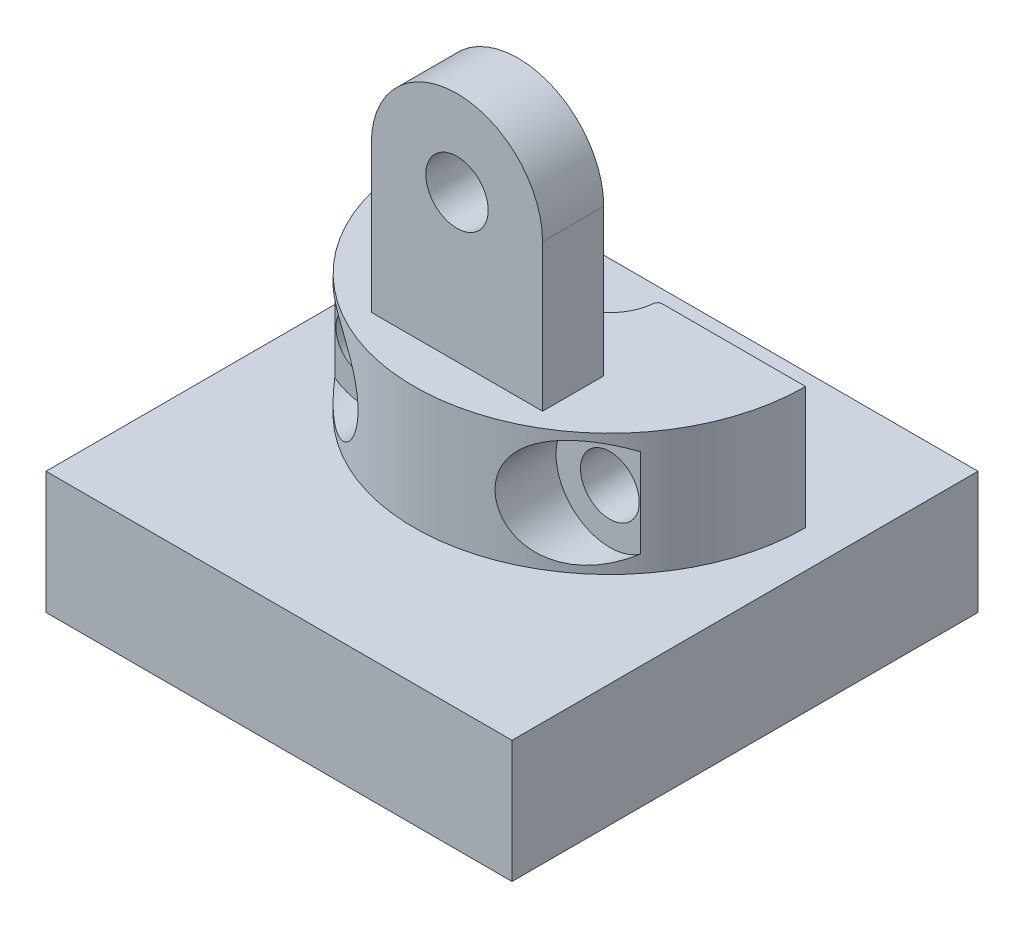
ISO-10303-21;
HEADER;
FILE_DESCRIPTION(('STEP AP214'),'2;1');
FILE_NAME('part.step','',(''),(''),'','','');
FILE_SCHEMA(('AUTOMOTIVE_DESIGN { 1 0 10303 214 1 1 1 1 }'));
ENDSEC;
DATA;
#1=APPLICATION_CONTEXT('core data for automotive mechanical design processes');
#2=APPLICATION_PROTOCOL_DEFINITION('international standard','automotive_design',2000,#1);
#3=PRODUCT_CONTEXT('',#1,'mechanical');
#4=PRODUCT('Part','Part','',(#3));
#5=PRODUCT_RELATED_PRODUCT_CATEGORY('part','',(#4));
#6=PRODUCT_DEFINITION_FORMATION('','',#4);
#7=PRODUCT_DEFINITION_CONTEXT('part definition',#1,'design');
#8=PRODUCT_DEFINITION('design','',#6,#7);
#9=PRODUCT_DEFINITION_SHAPE('','',#8);
#10=(LENGTH_UNIT() NAMED_UNIT(*) SI_UNIT(.MILLI.,.METRE.));
#11=(NAMED_UNIT(*) PLANE_ANGLE_UNIT() SI_UNIT($,.RADIAN.));
#12=(NAMED_UNIT(*) SI_UNIT($,.STERADIAN.) SOLID_ANGLE_UNIT());
#13=UNCERTAINTY_MEASURE_WITH_UNIT(LENGTH_MEASURE(1.E-05),#10,'distance_accuracy_value','');
#14=(GEOMETRIC_REPRESENTATION_CONTEXT(3) GLOBAL_UNCERTAINTY_ASSIGNED_CONTEXT((#13)) GLOBAL_UNIT_ASSIGNED_CONTEXT((#10,
#11,#12)) REPRESENTATION_CONTEXT('',''));
#15=CARTESIAN_POINT('',(0.,0.,0.));
#16=DIRECTION('',(0.,0.,1.));
#17=DIRECTION('',(1.,0.,0.));
#18=AXIS2_PLACEMENT_3D('',#15,#16,#17);
#19=CARTESIAN_POINT('',(3.5,12.,6.25));
#20=DIRECTION('',(0.,0.,1.));
#21=DIRECTION('',(1.,0.,0.));
#22=AXIS2_PLACEMENT_3D('',#19,#20,#21);
#23=PLANE('',#22);
#24=CARTESIAN_POINT('',(0.,8.5,6.25));
#25=DIRECTION('',(0.,0.,1.));
#26=DIRECTION('',(1.,0.,0.));
#27=AXIS2_PLACEMENT_3D('',#24,#25,#26);
#28=CIRCLE('',#27,1.275);
#29=CARTESIAN_POINT('',(1.275,8.5,6.25));
#30=VERTEX_POINT('',#29);
#31=EDGE_CURVE('E199',#30,#30,#28,.T.);
#32=ORIENTED_EDGE('',*,*,#31,.F.);
#33=EDGE_LOOP('',(#32));
#34=FACE_BOUND('',#33,.T.);
#35=DIRECTION('',(0.,-1.,0.));
#36=VECTOR('',#35,1.);
#37=CARTESIAN_POINT('',(3.5,12.,6.25));
#38=LINE('',#37,#36);
#39=CARTESIAN_POINT('',(3.5,8.5,6.25));
#40=VERTEX_POINT('',#39);
#41=CARTESIAN_POINT('',(3.5,2.5,6.25));
#42=VERTEX_POINT('',#41);
#43=EDGE_CURVE('E244',#40,#42,#38,.T.);
#44=ORIENTED_EDGE('',*,*,#43,.F.);
#45=CARTESIAN_POINT('',(0.,8.5,6.25));
#46=DIRECTION('',(0.,0.,1.));
#47=DIRECTION('',(1.,0.,0.));
#48=AXIS2_PLACEMENT_3D('',#45,#46,#47);
#49=CIRCLE('',#48,3.5);
#50=CARTESIAN_POINT('',(-3.5,8.5,6.25));
#51=VERTEX_POINT('',#50);
#52=EDGE_CURVE('E210',#40,#51,#49,.T.);
#53=ORIENTED_EDGE('',*,*,#52,.T.);
#54=DIRECTION('',(0.,-1.,0.));
#55=VECTOR('',#54,1.);
#56=CARTESIAN_POINT('',(-3.5,12.,6.25));
#57=LINE('',#56,#55);
#58=CARTESIAN_POINT('',(-3.5,2.5,6.25));
#59=VERTEX_POINT('',#58);
#60=EDGE_CURVE('E254',#51,#59,#57,.T.);
#61=ORIENTED_EDGE('',*,*,#60,.T.);
#62=DIRECTION('',(-1.,0.,0.));
#63=VECTOR('',#62,1.);
#64=CARTESIAN_POINT('',(3.5,2.5,6.25));
#65=LINE('',#64,#63);
#66=EDGE_CURVE('E212',#42,#59,#65,.T.);
#67=ORIENTED_EDGE('',*,*,#66,.F.);
#68=EDGE_LOOP('',(#44,#53,#61,#67));
#69=FACE_BOUND('',#68,.T.);
#70=ADVANCED_FACE('F37',(#34,#69),#23,.T.);
#71=CARTESIAN_POINT('',(3.5,12.,6.25));
#72=DIRECTION('',(-1.,0.,0.));
#73=DIRECTION('',(0.,0.,1.));
#74=AXIS2_PLACEMENT_3D('',#71,#72,#73);
#75=PLANE('',#74);
#76=DIRECTION('',(0.,0.,-1.));
#77=VECTOR('',#76,1.);
#78=CARTESIAN_POINT('',(3.5,8.5,13.25));
#79=LINE('',#78,#77);
#80=CARTESIAN_POINT('',(3.5,8.5,3.75));
#81=VERTEX_POINT('',#80);
#82=EDGE_CURVE('E205',#40,#81,#79,.T.);
#83=ORIENTED_EDGE('',*,*,#82,.F.);
#84=ORIENTED_EDGE('',*,*,#43,.T.);
#85=DIRECTION('',(0.,0.,-1.));
#86=VECTOR('',#85,1.);
#87=CARTESIAN_POINT('',(3.5,2.5,6.25));
#88=LINE('',#87,#86);
#89=CARTESIAN_POINT('',(3.5,2.5,3.75));
#90=VERTEX_POINT('',#89);
#91=EDGE_CURVE('E257',#42,#90,#88,.T.);
#92=ORIENTED_EDGE('',*,*,#91,.T.);
#93=DIRECTION('',(0.,-1.,0.));
#94=VECTOR('',#93,1.);
#95=CARTESIAN_POINT('',(3.5,12.,3.75));
#96=LINE('',#95,#94);
#97=EDGE_CURVE('E259',#81,#90,#96,.T.);
#98=ORIENTED_EDGE('',*,*,#97,.F.);
#99=EDGE_LOOP('',(#83,#84,#92,#98));
#100=FACE_BOUND('',#99,.T.);
#101=ADVANCED_FACE('F282',(#100),#75,.F.);
#102=CARTESIAN_POINT('',(3.5,12.,3.75));
#103=DIRECTION('',(0.,0.,1.));
#104=DIRECTION('',(1.,0.,0.));
#105=AXIS2_PLACEMENT_3D('',#102,#103,#104);
#106=PLANE('',#105);
#107=CARTESIAN_POINT('',(0.,8.5,3.75));
#108=DIRECTION('',(0.,0.,-1.));
#109=DIRECTION('',(-1.,0.,0.));
#110=AXIS2_PLACEMENT_3D('',#107,#108,#109);
#111=CIRCLE('',#110,1.275);
#112=CARTESIAN_POINT('',(-1.275,8.5,3.75));
#113=VERTEX_POINT('',#112);
#114=EDGE_CURVE('E196',#113,#113,#111,.T.);
#115=ORIENTED_EDGE('',*,*,#114,.F.);
#116=EDGE_LOOP('',(#115));
#117=FACE_BOUND('',#116,.T.);
#118=CARTESIAN_POINT('',(0.,8.5,3.75));
#119=DIRECTION('',(0.,0.,-1.));
#120=DIRECTION('',(-1.,0.,0.));
#121=AXIS2_PLACEMENT_3D('',#118,#119,#120);
#122=CIRCLE('',#121,3.5);
#123=CARTESIAN_POINT('',(-3.5,8.5,3.75));
#124=VERTEX_POINT('',#123);
#125=EDGE_CURVE('E202',#124,#81,#122,.T.);
#126=ORIENTED_EDGE('',*,*,#125,.T.);
#127=ORIENTED_EDGE('',*,*,#97,.T.);
#128=DIRECTION('',(-1.,0.,0.));
#129=VECTOR('',#128,1.);
#130=CARTESIAN_POINT('',(3.5,2.5,3.75));
#131=LINE('',#130,#129);
#132=CARTESIAN_POINT('',(-3.5,2.5,3.75));
#133=VERTEX_POINT('',#132);
#134=EDGE_CURVE('E219',#90,#133,#131,.T.);
#135=ORIENTED_EDGE('',*,*,#134,.T.);
#136=DIRECTION('',(0.,-1.,0.));
#137=VECTOR('',#136,1.);
#138=CARTESIAN_POINT('',(-3.5,12.,3.75));
#139=LINE('',#138,#137);
#140=EDGE_CURVE('E256',#124,#133,#139,.T.);
#141=ORIENTED_EDGE('',*,*,#140,.F.);
#142=EDGE_LOOP('',(#126,#127,#135,#141));
#143=FACE_BOUND('',#142,.T.);
#144=ADVANCED_FACE('F269',(#117,#143),#106,.F.);
#145=CARTESIAN_POINT('',(0.,2.5,0.));
#146=DIRECTION('',(0.,-1.,0.));
#147=DIRECTION('',(0.,0.,-1.));
#148=AXIS2_PLACEMENT_3D('',#145,#146,#147);
#149=CYLINDRICAL_SURFACE('',#148,1.96);
#150=CARTESIAN_POINT('',(0.,-2.5,0.));
#151=DIRECTION('',(0.,-1.,0.));
#152=DIRECTION('',(0.,0.,-1.));
#153=AXIS2_PLACEMENT_3D('',#150,#151,#152);
#154=CIRCLE('',#153,1.96);
#155=CARTESIAN_POINT('',(1.95157999371773,-2.5,0.181481481481481));
#156=VERTEX_POINT('',#155);
#157=CARTESIAN_POINT('',(-1.95157999371773,-2.5,0.181481481481481));
#158=VERTEX_POINT('',#157);
#159=EDGE_CURVE('E240',#156,#158,#154,.T.);
#160=ORIENTED_EDGE('',*,*,#159,.T.);
#161=DIRECTION('',(0.,-1.,0.));
#162=VECTOR('',#161,1.);
#163=CARTESIAN_POINT('',(-1.95157999371773,2.5,0.181481481481481));
#164=LINE('',#163,#162);
#165=CARTESIAN_POINT('',(-1.95157999371773,2.5,0.181481481481481));
#166=VERTEX_POINT('',#165);
#167=EDGE_CURVE('E390',#158,#166,#164,.F.);
#168=ORIENTED_EDGE('',*,*,#167,.T.);
#169=CARTESIAN_POINT('',(0.,2.5,0.));
#170=DIRECTION('',(0.,-1.,0.));
#171=DIRECTION('',(0.,0.,-1.));
#172=AXIS2_PLACEMENT_3D('',#169,#170,#171);
#173=CIRCLE('',#172,1.96);
#174=CARTESIAN_POINT('',(1.95157999371773,2.5,0.181481481481481));
#175=VERTEX_POINT('',#174);
#176=EDGE_CURVE('E229',#175,#166,#173,.T.);
#177=ORIENTED_EDGE('',*,*,#176,.F.);
#178=DIRECTION('',(0.,-1.,0.));
#179=VECTOR('',#178,1.);
#180=CARTESIAN_POINT('',(1.95157999371773,2.5,0.181481481481481));
#181=LINE('',#180,#179);
#182=EDGE_CURVE('E404',#175,#156,#181,.T.);
#183=ORIENTED_EDGE('',*,*,#182,.T.);
#184=EDGE_LOOP('',(#160,#168,#177,#183));
#185=FACE_BOUND('',#184,.T.);
#186=ADVANCED_FACE('F364',(#185),#149,.F.);
#187=CARTESIAN_POINT('',(-1.96,2.5,0.));
#188=DIRECTION('',(0.,0.,1.));
#189=DIRECTION('',(1.,0.,0.));
#190=AXIS2_PLACEMENT_3D('',#187,#188,#189);
#191=PLANE('',#190);
#192=CARTESIAN_POINT('',(-5.,0.,0.));
#193=DIRECTION('',(0.,0.,1.));
#194=DIRECTION('',(1.,0.,0.));
#195=AXIS2_PLACEMENT_3D('',#192,#193,#194);
#196=CIRCLE('',#195,1.2);
#197=CARTESIAN_POINT('',(-3.8,0.,0.));
#198=VERTEX_POINT('',#197);
#199=EDGE_CURVE('E193',#198,#198,#196,.T.);
#200=ORIENTED_EDGE('',*,*,#199,.T.);
#201=EDGE_LOOP('',(#200));
#202=FACE_BOUND('',#201,.T.);
#203=DIRECTION('',(-1.,0.,0.));
#204=VECTOR('',#203,1.);
#205=CARTESIAN_POINT('',(-1.96,2.5,0.));
#206=LINE('',#205,#204);
#207=CARTESIAN_POINT('',(-2.15072080940321,2.5,0.));
#208=VERTEX_POINT('',#207);
#209=CARTESIAN_POINT('',(-8.,2.5,0.));
#210=VERTEX_POINT('',#209);
#211=EDGE_CURVE('E250',#208,#210,#206,.T.);
#212=ORIENTED_EDGE('',*,*,#211,.F.);
#213=DIRECTION('',(0.,-1.,0.));
#214=VECTOR('',#213,1.);
#215=CARTESIAN_POINT('',(-2.15072080940321,2.5,0.));
#216=LINE('',#215,#214);
#217=CARTESIAN_POINT('',(-2.15072080940321,-2.5,0.));
#218=VERTEX_POINT('',#217);
#219=EDGE_CURVE('E392',#208,#218,#216,.T.);
#220=ORIENTED_EDGE('',*,*,#219,.T.);
#221=DIRECTION('',(-1.,0.,0.));
#222=VECTOR('',#221,1.);
#223=CARTESIAN_POINT('',(-1.96,-2.5,0.));
#224=LINE('',#223,#222);
#225=CARTESIAN_POINT('',(-8.,-2.5,0.));
#226=VERTEX_POINT('',#225);
#227=EDGE_CURVE('E237',#218,#226,#224,.T.);
#228=ORIENTED_EDGE('',*,*,#227,.T.);
#229=DIRECTION('',(0.,-1.,0.));
#230=VECTOR('',#229,1.);
#231=CARTESIAN_POINT('',(-8.,2.5,0.));
#232=LINE('',#231,#230);
#233=EDGE_CURVE('E422',#210,#226,#232,.T.);
#234=ORIENTED_EDGE('',*,*,#233,.F.);
#235=EDGE_LOOP('',(#212,#220,#228,#234));
#236=FACE_BOUND('',#235,.T.);
#237=ADVANCED_FACE('F306',(#202,#236),#191,.F.);
#238=CARTESIAN_POINT('',(0.,2.5,0.));
#239=DIRECTION('',(0.,-1.,0.));
#240=DIRECTION('',(0.,0.,-1.));
#241=AXIS2_PLACEMENT_3D('',#238,#239,#240);
#242=CYLINDRICAL_SURFACE('',#241,8.);
#243=DIRECTION('',(0.,-1.,0.));
#244=VECTOR('',#243,1.);
#245=CARTESIAN_POINT('',(6.2449979983984,2.5,5.));
#246=LINE('',#245,#244);
#247=CARTESIAN_POINT('',(6.2449979983984,1.81383019711989,5.));
#248=VERTEX_POINT('',#247);
#249=CARTESIAN_POINT('',(6.2449979983984,-1.81383019711989,5.));
#250=VERTEX_POINT('',#249);
#251=EDGE_CURVE('E327',#248,#250,#246,.T.);
#252=ORIENTED_EDGE('',*,*,#251,.T.);
#253=CARTESIAN_POINT('',(6.2449979983984,-1.81383019711989,5.));
#254=CARTESIAN_POINT('',(6.17663860592241,-1.8607102834588,5.08540212173734));
#255=CARTESIAN_POINT('',(6.10549519642224,-1.90389776412766,5.17064944179791));
#256=CARTESIAN_POINT('',(5.95769073945838,-1.98239403807314,5.34027558496621));
#257=CARTESIAN_POINT('',(5.88101997446032,-2.01768848490826,5.42465256493792));
#258=CARTESIAN_POINT('',(5.72167796067273,-2.08003768105955,5.59248871845806));
#259=CARTESIAN_POINT('',(5.63895503716553,-2.10700782760362,5.67593066012418));
#260=CARTESIAN_POINT('',(5.46862895756308,-2.15130847146899,5.84021356424412));
#261=CARTESIAN_POINT('',(5.38102981779722,-2.16864677656134,5.92105658320298));
#262=CARTESIAN_POINT('',(5.16408914189433,-2.19761714024674,6.11235090478948));
#263=CARTESIAN_POINT('',(5.03251052155223,-2.20389550475201,6.22116736617875));
#264=CARTESIAN_POINT('',(4.76376961945145,-2.19138593064291,6.42924356138917));
#265=CARTESIAN_POINT('',(4.62663374461121,-2.17270552800541,6.52854233126517));
#266=CARTESIAN_POINT('',(4.38499438405445,-2.11498966742177,6.6923573050568));
#267=CARTESIAN_POINT('',(4.28075459328574,-2.08208552215906,6.75942394459143));
#268=CARTESIAN_POINT('',(4.07438089621389,-1.99889729341654,6.88578440694051));
#269=CARTESIAN_POINT('',(3.97224715500588,-1.94861185284847,6.94507762232662));
#270=CARTESIAN_POINT('',(3.77642686696404,-1.83180367159578,7.05342442007826));
#271=CARTESIAN_POINT('',(3.68258590544246,-1.76576119453198,7.10271317228207));
#272=CARTESIAN_POINT('',(3.50404841981326,-1.61728086688121,7.19247087999335));
#273=CARTESIAN_POINT('',(3.41935045109385,-1.53484561225418,7.23294122985889));
#274=CARTESIAN_POINT('',(3.26258125551041,-1.35486421807502,7.30500184587568));
#275=CARTESIAN_POINT('',(3.19054757401096,-1.25727470989678,7.33656586969469));
#276=CARTESIAN_POINT('',(3.06275519423315,-1.04972764254948,7.39083052225789));
#277=CARTESIAN_POINT('',(3.00699558129236,-0.939770778952615,7.41353164915367));
#278=CARTESIAN_POINT('',(2.91655056743105,-0.716296077405375,7.4495637705695));
#279=CARTESIAN_POINT('',(2.88099080849888,-0.603194713378326,7.46328823402145));
#280=CARTESIAN_POINT('',(2.8284674897464,-0.372126724375028,7.4833530594277));
#281=CARTESIAN_POINT('',(2.81150135884821,-0.254160774402274,7.48969444230248));
#282=CARTESIAN_POINT('',(2.79701611341606,-0.0194956684011316,7.49511559529466));
#283=CARTESIAN_POINT('',(2.79907712949005,0.0971742098036563,7.49435214375621));
#284=CARTESIAN_POINT('',(2.8215589099335,0.328468012502649,7.48591656357002));
#285=CARTESIAN_POINT('',(2.84197787893106,0.443092135949723,7.4782451105112));
#286=CARTESIAN_POINT('',(2.90028750712632,0.66672589423237,7.45582293202285));
#287=CARTESIAN_POINT('',(2.93812856387018,0.77575049837395,7.44109229995911));
#288=CARTESIAN_POINT('',(3.02977018092827,0.985544328622235,7.40424988459547));
#289=CARTESIAN_POINT('',(3.0835734163882,1.0863121673393,7.38213686398274));
#290=CARTESIAN_POINT('',(3.20559261947389,1.27794517322249,7.32998027725017));
#291=CARTESIAN_POINT('',(3.27395239109038,1.36869669634901,7.2998567764045));
#292=CARTESIAN_POINT('',(3.42192181315994,1.53694484268976,7.23166993986864));
#293=CARTESIAN_POINT('',(3.50152064511513,1.61445405595442,7.1936142229907));
#294=CARTESIAN_POINT('',(3.63101896966027,1.72322173103639,7.12869863861583));
#295=CARTESIAN_POINT('',(3.67810398493254,1.7595634833854,7.10454012091781));
#296=CARTESIAN_POINT('',(3.77420425269416,1.82781253333738,7.05395916171292));
#297=CARTESIAN_POINT('',(3.82321904621537,1.85972087727945,7.0275372567812));
#298=CARTESIAN_POINT('',(3.9897849303121,1.95906072319958,6.935367417718));
#299=CARTESIAN_POINT('',(4.11071543998058,2.0164422957166,6.86459051921834));
#300=CARTESIAN_POINT('',(4.35490644458693,2.10735258482268,6.71234752122969));
#301=CARTESIAN_POINT('',(4.47817186543769,2.14082330276661,6.63085599466348));
#302=CARTESIAN_POINT('',(4.72136790181883,2.18575324923757,6.45992204116997));
#303=CARTESIAN_POINT('',(4.84131847825671,2.1974065771265,6.37055720476197));
#304=CARTESIAN_POINT('',(5.07629158578847,2.20182198732416,6.1849599377646));
#305=CARTESIAN_POINT('',(5.1913069937795,2.19455763954401,6.08871808185949));
#306=CARTESIAN_POINT('',(5.39130821831495,2.16676125276994,5.91166486333021));
#307=CARTESIAN_POINT('',(5.47757950409327,2.14928907900335,5.83178653220391));
#308=CARTESIAN_POINT('',(5.64536499660364,2.10500236098038,5.66952233421631));
#309=CARTESIAN_POINT('',(5.72687499807349,2.07817969961056,5.58713434562909));
#310=CARTESIAN_POINT('',(5.8843079933464,2.01621761945985,5.42106396183936));
#311=CARTESIAN_POINT('',(5.96025731081525,1.98112122350357,5.33739028859142));
#312=CARTESIAN_POINT('',(6.10670975547091,1.90316086192666,5.16919363120081));
#313=CARTESIAN_POINT('',(6.17722248255756,1.86031105701964,5.08467245645436));
#314=CARTESIAN_POINT('',(6.2449979983984,1.81383019711989,5.));
#315=B_SPLINE_CURVE_WITH_KNOTS('',3,(#253,#254,#255,#256,#257,#258,#259,#260,#261,#262,#263,
#264,#265,#266,#267,#268,#269,#270,#271,#272,#273,#274,#275,#276,#277,#278,#279,#280,#281,#282,
#283,#284,#285,#286,#287,#288,#289,#290,#291,#292,#293,#294,#295,#296,#297,#298,#299,#300,#301,
#302,#303,#304,#305,#306,#307,#308,#309,#310,#311,#312,#313,#314),.UNSPECIFIED.,.F.,.F.,(4,2,2,
2,2,2,2,2,2,2,2,2,2,2,2,2,2,2,2,2,2,2,2,2,2,2,2,2,2,2,4),(0.,0.35699969113477,0.714643087099744,
1.07580996682675,1.43668364835811,1.94731114826102,2.45574566592024,2.83921706165494,
3.22271840464722,3.59576009942669,3.96874276630761,4.34281320965901,4.71686262482717,
5.07316506467093,5.42941822973354,5.77782912651581,6.12620595309968,6.4735969913803,
6.82104628280647,7.17210201499016,7.52282210281324,7.71521429132904,7.9075609955025,
8.35901715480478,8.81156469085849,9.26006662636514,9.70919550482479,10.0652944639521,
10.4217033238513,10.776298245003,11.1302519587186),.UNSPECIFIED.);
#316=EDGE_CURVE('E319',#250,#248,#315,.T.);
#317=ORIENTED_EDGE('',*,*,#316,.T.);
#318=EDGE_LOOP('',(#252,#317));
#319=FACE_BOUND('',#318,.T.);
#320=DIRECTION('',(0.,-1.,0.));
#321=VECTOR('',#320,1.);
#322=CARTESIAN_POINT('',(-6.2449979983984,2.5,5.));
#323=LINE('',#322,#321);
#324=CARTESIAN_POINT('',(-6.2449979983984,-1.81383019711989,5.));
#325=VERTEX_POINT('',#324);
#326=CARTESIAN_POINT('',(-6.2449979983984,1.81383019711989,5.));
#327=VERTEX_POINT('',#326);
#328=EDGE_CURVE('E328',#325,#327,#323,.F.);
#329=ORIENTED_EDGE('',*,*,#328,.T.);
#330=CARTESIAN_POINT('',(-6.2449979983984,1.81383019711989,5.));
#331=CARTESIAN_POINT('',(-6.17663860592241,1.8607102834588,5.08540212173734));
#332=CARTESIAN_POINT('',(-6.10549519642224,1.90389776412766,5.17064944179791));
#333=CARTESIAN_POINT('',(-5.95769073945838,1.98239403807314,5.34027558496621));
#334=CARTESIAN_POINT('',(-5.88101997446032,2.01768848490826,5.42465256493792));
#335=CARTESIAN_POINT('',(-5.72167796067273,2.08003768105955,5.59248871845806));
#336=CARTESIAN_POINT('',(-5.63895503716553,2.10700782760362,5.67593066012418));
#337=CARTESIAN_POINT('',(-5.46862895756308,2.15130847146899,5.84021356424412));
#338=CARTESIAN_POINT('',(-5.38102981779722,2.16864677656134,5.92105658320298));
#339=CARTESIAN_POINT('',(-5.16408914189433,2.19761714024674,6.11235090478948));
#340=CARTESIAN_POINT('',(-5.03251052155223,2.20389550475201,6.22116736617875));
#341=CARTESIAN_POINT('',(-4.76376961945145,2.19138593064291,6.42924356138917));
#342=CARTESIAN_POINT('',(-4.62663374461121,2.17270552800541,6.52854233126517));
#343=CARTESIAN_POINT('',(-4.38499438405445,2.11498966742177,6.6923573050568));
#344=CARTESIAN_POINT('',(-4.28075459328574,2.08208552215906,6.75942394459143));
#345=CARTESIAN_POINT('',(-4.07438089621389,1.99889729341654,6.88578440694051));
#346=CARTESIAN_POINT('',(-3.97224715500588,1.94861185284847,6.94507762232662));
#347=CARTESIAN_POINT('',(-3.77642686696404,1.83180367159578,7.05342442007826));
#348=CARTESIAN_POINT('',(-3.68258590544246,1.76576119453198,7.10271317228207));
#349=CARTESIAN_POINT('',(-3.50404841981326,1.61728086688121,7.19247087999335));
#350=CARTESIAN_POINT('',(-3.41935045109385,1.53484561225418,7.23294122985889));
#351=CARTESIAN_POINT('',(-3.26258125551041,1.35486421807502,7.30500184587569));
#352=CARTESIAN_POINT('',(-3.19054757401096,1.25727470989678,7.33656586969469));
#353=CARTESIAN_POINT('',(-3.06275519423315,1.04972764254947,7.39083052225789));
#354=CARTESIAN_POINT('',(-3.00699558129236,0.939770778952614,7.41353164915367));
#355=CARTESIAN_POINT('',(-2.91655056743106,0.716296077405374,7.4495637705695));
#356=CARTESIAN_POINT('',(-2.88099080849888,0.603194713378326,7.46328823402145));
#357=CARTESIAN_POINT('',(-2.8284674897464,0.372126724375029,7.4833530594277));
#358=CARTESIAN_POINT('',(-2.81150135884821,0.254160774402274,7.48969444230248));
#359=CARTESIAN_POINT('',(-2.79701611341606,0.0194956684011318,7.49511559529466));
#360=CARTESIAN_POINT('',(-2.79907712949005,-0.0971742098036562,7.49435214375621));
#361=CARTESIAN_POINT('',(-2.8215589099335,-0.328468012502649,7.48591656357002));
#362=CARTESIAN_POINT('',(-2.84197787893106,-0.443092135949722,7.47824511051119));
#363=CARTESIAN_POINT('',(-2.90028750712632,-0.66672589423237,7.45582293202285));
#364=CARTESIAN_POINT('',(-2.93812856387018,-0.77575049837395,7.44109229995911));
#365=CARTESIAN_POINT('',(-3.02977018092827,-0.985544328622235,7.40424988459547));
#366=CARTESIAN_POINT('',(-3.0835734163882,-1.0863121673393,7.38213686398274));
#367=CARTESIAN_POINT('',(-3.20559261947389,-1.27794517322249,7.32998027725017));
#368=CARTESIAN_POINT('',(-3.27395239109038,-1.36869669634901,7.2998567764045));
#369=CARTESIAN_POINT('',(-3.42192181315994,-1.53694484268976,7.23166993986864));
#370=CARTESIAN_POINT('',(-3.50152064511513,-1.61445405595442,7.1936142229907));
#371=CARTESIAN_POINT('',(-3.63101896966027,-1.72322173103639,7.12869863861583));
#372=CARTESIAN_POINT('',(-3.67810398493254,-1.7595634833854,7.10454012091781));
#373=CARTESIAN_POINT('',(-3.77420425269416,-1.82781253333738,7.05395916171292));
#374=CARTESIAN_POINT('',(-3.82321904621537,-1.85972087727945,7.0275372567812));
#375=CARTESIAN_POINT('',(-3.9897849303121,-1.95906072319958,6.935367417718));
#376=CARTESIAN_POINT('',(-4.11071543998058,-2.0164422957166,6.86459051921834));
#377=CARTESIAN_POINT('',(-4.35490644458693,-2.10735258482268,6.71234752122969));
#378=CARTESIAN_POINT('',(-4.47817186543769,-2.14082330276661,6.63085599466348));
#379=CARTESIAN_POINT('',(-4.72136790181883,-2.18575324923757,6.45992204116997));
#380=CARTESIAN_POINT('',(-4.84131847825672,-2.1974065771265,6.37055720476197));
#381=CARTESIAN_POINT('',(-5.07629158578847,-2.20182198732416,6.1849599377646));
#382=CARTESIAN_POINT('',(-5.1913069937795,-2.19455763954401,6.08871808185949));
#383=CARTESIAN_POINT('',(-5.39130821831495,-2.16676125276994,5.91166486333021));
#384=CARTESIAN_POINT('',(-5.47757950409327,-2.14928907900335,5.83178653220391));
#385=CARTESIAN_POINT('',(-5.64536499660364,-2.10500236098038,5.66952233421631));
#386=CARTESIAN_POINT('',(-5.72687499807349,-2.07817969961056,5.58713434562909));
#387=CARTESIAN_POINT('',(-5.8843079933464,-2.01621761945985,5.42106396183936));
#388=CARTESIAN_POINT('',(-5.96025731081525,-1.98112122350357,5.33739028859142));
#389=CARTESIAN_POINT('',(-6.10670975547091,-1.90316086192666,5.16919363120081));
#390=CARTESIAN_POINT('',(-6.17722248255756,-1.86031105701964,5.08467245645436));
#391=CARTESIAN_POINT('',(-6.2449979983984,-1.81383019711989,5.));
#392=B_SPLINE_CURVE_WITH_KNOTS('',3,(#330,#331,#332,#333,#334,#335,#336,#337,#338,#339,#340,
#341,#342,#343,#344,#345,#346,#347,#348,#349,#350,#351,#352,#353,#354,#355,#356,#357,#358,#359,
#360,#361,#362,#363,#364,#365,#366,#367,#368,#369,#370,#371,#372,#373,#374,#375,#376,#377,#378,
#379,#380,#381,#382,#383,#384,#385,#386,#387,#388,#389,#390,#391),.UNSPECIFIED.,.F.,.F.,(4,2,2,
2,2,2,2,2,2,2,2,2,2,2,2,2,2,2,2,2,2,2,2,2,2,2,2,2,2,2,4),(0.,0.35699969113477,0.714643087099744,
1.07580996682675,1.43668364835811,1.94731114826101,2.45574566592024,2.83921706165494,
3.22271840464722,3.59576009942669,3.96874276630761,4.34281320965901,4.71686262482717,
5.07316506467092,5.42941822973354,5.77782912651581,6.12620595309968,6.4735969913803,
6.82104628280646,7.17210201499015,7.52282210281324,7.71521429132904,7.90756099550249,
8.35901715480477,8.81156469085849,9.26006662636513,9.70919550482479,10.0652944639521,
10.4217033238513,10.776298245003,11.1302519587186),.UNSPECIFIED.);
#393=EDGE_CURVE('E311',#327,#325,#392,.T.);
#394=ORIENTED_EDGE('',*,*,#393,.T.);
#395=EDGE_LOOP('',(#329,#394));
#396=FACE_BOUND('',#395,.T.);
#397=CARTESIAN_POINT('',(0.,-2.5,0.));
#398=DIRECTION('',(0.,1.,0.));
#399=DIRECTION('',(0.,0.,1.));
#400=AXIS2_PLACEMENT_3D('',#397,#398,#399);
#401=CIRCLE('',#400,8.);
#402=CARTESIAN_POINT('',(8.,-2.5,0.));
#403=VERTEX_POINT('',#402);
#404=EDGE_CURVE('E230',#226,#403,#401,.T.);
#405=ORIENTED_EDGE('',*,*,#404,.T.);
#406=DIRECTION('',(0.,-1.,0.));
#407=VECTOR('',#406,1.);
#408=CARTESIAN_POINT('',(8.,2.5,0.));
#409=LINE('',#408,#407);
#410=CARTESIAN_POINT('',(8.,2.5,0.));
#411=VERTEX_POINT('',#410);
#412=EDGE_CURVE('E232',#411,#403,#409,.T.);
#413=ORIENTED_EDGE('',*,*,#412,.F.);
#414=CARTESIAN_POINT('',(0.,2.5,0.));
#415=DIRECTION('',(0.,1.,0.));
#416=DIRECTION('',(0.,0.,1.));
#417=AXIS2_PLACEMENT_3D('',#414,#415,#416);
#418=CIRCLE('',#417,8.);
#419=EDGE_CURVE('E247',#210,#411,#418,.T.);
#420=ORIENTED_EDGE('',*,*,#419,.F.);
#421=ORIENTED_EDGE('',*,*,#233,.T.);
#422=EDGE_LOOP('',(#405,#413,#420,#421));
#423=FACE_BOUND('',#422,.T.);
#424=ADVANCED_FACE('F301',(#319,#396,#423),#242,.T.);
#425=CARTESIAN_POINT('',(1.96,2.5,0.));
#426=DIRECTION('',(0.,0.,-1.));
#427=DIRECTION('',(-1.,0.,0.));
#428=AXIS2_PLACEMENT_3D('',#425,#426,#427);
#429=PLANE('',#428);
#430=CARTESIAN_POINT('',(5.,0.,0.));
#431=DIRECTION('',(0.,0.,-1.));
#432=DIRECTION('',(-1.,0.,0.));
#433=AXIS2_PLACEMENT_3D('',#430,#431,#432);
#434=CIRCLE('',#433,1.2);
#435=CARTESIAN_POINT('',(3.8,0.,0.));
#436=VERTEX_POINT('',#435);
#437=EDGE_CURVE('E184',#436,#436,#434,.T.);
#438=ORIENTED_EDGE('',*,*,#437,.F.);
#439=EDGE_LOOP('',(#438));
#440=FACE_BOUND('',#439,.T.);
#441=DIRECTION('',(1.,0.,0.));
#442=VECTOR('',#441,1.);
#443=CARTESIAN_POINT('',(1.96,-2.5,0.));
#444=LINE('',#443,#442);
#445=CARTESIAN_POINT('',(2.15072080940321,-2.5,0.));
#446=VERTEX_POINT('',#445);
#447=EDGE_CURVE('E226',#446,#403,#444,.T.);
#448=ORIENTED_EDGE('',*,*,#447,.F.);
#449=DIRECTION('',(0.,1.,0.));
#450=VECTOR('',#449,1.);
#451=CARTESIAN_POINT('',(2.15072080940321,2.5,0.));
#452=LINE('',#451,#450);
#453=CARTESIAN_POINT('',(2.15072080940321,2.5,0.));
#454=VERTEX_POINT('',#453);
#455=EDGE_CURVE('E57',#446,#454,#452,.T.);
#456=ORIENTED_EDGE('',*,*,#455,.T.);
#457=DIRECTION('',(1.,0.,0.));
#458=VECTOR('',#457,1.);
#459=CARTESIAN_POINT('',(1.96,2.5,0.));
#460=LINE('',#459,#458);
#461=EDGE_CURVE('E245',#454,#411,#460,.T.);
#462=ORIENTED_EDGE('',*,*,#461,.T.);
#463=ORIENTED_EDGE('',*,*,#412,.T.);
#464=EDGE_LOOP('',(#448,#456,#462,#463));
#465=FACE_BOUND('',#464,.T.);
#466=ADVANCED_FACE('F298',(#440,#465),#429,.T.);
#467=CARTESIAN_POINT('',(0.,2.5,0.));
#468=DIRECTION('',(0.,-1.,0.));
#469=DIRECTION('',(0.,0.,-1.));
#470=AXIS2_PLACEMENT_3D('',#467,#468,#469);
#471=PLANE('',#470);
#472=ORIENTED_EDGE('',*,*,#91,.F.);
#473=ORIENTED_EDGE('',*,*,#66,.T.);
#474=DIRECTION('',(0.,0.,1.));
#475=VECTOR('',#474,1.);
#476=CARTESIAN_POINT('',(-3.5,2.5,3.75));
#477=LINE('',#476,#475);
#478=EDGE_CURVE('E215',#133,#59,#477,.T.);
#479=ORIENTED_EDGE('',*,*,#478,.F.);
#480=ORIENTED_EDGE('',*,*,#134,.F.);
#481=EDGE_LOOP('',(#472,#473,#479,#480));
#482=FACE_BOUND('',#481,.T.);
#483=ORIENTED_EDGE('',*,*,#176,.T.);
#484=CARTESIAN_POINT('',(-2.15072080940321,2.5,0.2));
#485=DIRECTION('',(0.,-1.,0.));
#486=DIRECTION('',(0.,0.,-1.));
#487=AXIS2_PLACEMENT_3D('',#484,#485,#486);
#488=CIRCLE('',#487,0.2);
#489=EDGE_CURVE('E389',#166,#208,#488,.F.);
#490=ORIENTED_EDGE('',*,*,#489,.T.);
#491=ORIENTED_EDGE('',*,*,#211,.T.);
#492=ORIENTED_EDGE('',*,*,#419,.T.);
#493=ORIENTED_EDGE('',*,*,#461,.F.);
#494=CARTESIAN_POINT('',(2.15072080940321,2.5,0.2));
#495=DIRECTION('',(0.,-1.,0.));
#496=DIRECTION('',(0.,0.,-1.));
#497=AXIS2_PLACEMENT_3D('',#494,#495,#496);
#498=CIRCLE('',#497,0.2);
#499=EDGE_CURVE('E394',#454,#175,#498,.F.);
#500=ORIENTED_EDGE('',*,*,#499,.T.);
#501=EDGE_LOOP('',(#483,#490,#491,#492,#493,#500));
#502=FACE_BOUND('',#501,.T.);
#503=ADVANCED_FACE('F272',(#482,#502),#471,.F.);
#504=CARTESIAN_POINT('',(-3.5,12.,3.75));
#505=DIRECTION('',(1.,0.,0.));
#506=DIRECTION('',(0.,0.,-1.));
#507=AXIS2_PLACEMENT_3D('',#504,#505,#506);
#508=PLANE('',#507);
#509=ORIENTED_EDGE('',*,*,#60,.F.);
#510=DIRECTION('',(0.,0.,-1.));
#511=VECTOR('',#510,1.);
#512=CARTESIAN_POINT('',(-3.5,8.5,13.25));
#513=LINE('',#512,#511);
#514=EDGE_CURVE('E207',#51,#124,#513,.T.);
#515=ORIENTED_EDGE('',*,*,#514,.T.);
#516=ORIENTED_EDGE('',*,*,#140,.T.);
#517=ORIENTED_EDGE('',*,*,#478,.T.);
#518=EDGE_LOOP('',(#509,#515,#516,#517));
#519=FACE_BOUND('',#518,.T.);
#520=ADVANCED_FACE('F277',(#519),#508,.F.);
#521=CARTESIAN_POINT('',(0.,8.5,13.25));
#522=DIRECTION('',(0.,0.,-1.));
#523=DIRECTION('',(-1.,0.,0.));
#524=AXIS2_PLACEMENT_3D('',#521,#522,#523);
#525=CYLINDRICAL_SURFACE('',#524,3.5);
#526=ORIENTED_EDGE('',*,*,#82,.T.);
#527=ORIENTED_EDGE('',*,*,#125,.F.);
#528=ORIENTED_EDGE('',*,*,#514,.F.);
#529=ORIENTED_EDGE('',*,*,#52,.F.);
#530=EDGE_LOOP('',(#526,#527,#528,#529));
#531=FACE_BOUND('',#530,.T.);
#532=ADVANCED_FACE('F280',(#531),#525,.T.);
#533=CARTESIAN_POINT('',(0.,8.5,13.25));
#534=DIRECTION('',(0.,0.,-1.));
#535=DIRECTION('',(-1.,0.,0.));
#536=AXIS2_PLACEMENT_3D('',#533,#534,#535);
#537=CYLINDRICAL_SURFACE('',#536,1.275);
#538=ORIENTED_EDGE('',*,*,#31,.T.);
#539=EDGE_LOOP('',(#538));
#540=FACE_BOUND('',#539,.T.);
#541=ORIENTED_EDGE('',*,*,#114,.T.);
#542=EDGE_LOOP('',(#541));
#543=FACE_BOUND('',#542,.T.);
#544=ADVANCED_FACE('F354',(#540,#543),#537,.F.);
#545=CARTESIAN_POINT('',(-3.8,0.,5.));
#546=DIRECTION('',(0.,0.,-1.));
#547=DIRECTION('',(-1.,0.,0.));
#548=AXIS2_PLACEMENT_3D('',#545,#546,#547);
#549=PLANE('',#548);
#550=CARTESIAN_POINT('',(-5.,0.,5.));
#551=DIRECTION('',(0.,0.,1.));
#552=DIRECTION('',(1.,0.,0.));
#553=AXIS2_PLACEMENT_3D('',#550,#551,#552);
#554=CIRCLE('',#553,1.2);
#555=CARTESIAN_POINT('',(-3.8,0.,5.));
#556=VERTEX_POINT('',#555);
#557=EDGE_CURVE('E190',#556,#556,#554,.T.);
#558=ORIENTED_EDGE('',*,*,#557,.F.);
#559=EDGE_LOOP('',(#558));
#560=FACE_BOUND('',#559,.T.);
#561=CARTESIAN_POINT('',(-5.,0.,5.));
#562=DIRECTION('',(0.,0.,1.));
#563=DIRECTION('',(1.,0.,0.));
#564=AXIS2_PLACEMENT_3D('',#561,#562,#563);
#565=CIRCLE('',#564,2.2);
#566=EDGE_CURVE('E187',#325,#327,#565,.T.);
#567=ORIENTED_EDGE('',*,*,#566,.T.);
#568=ORIENTED_EDGE('',*,*,#328,.F.);
#569=EDGE_LOOP('',(#567,#568));
#570=FACE_BOUND('',#569,.T.);
#571=ADVANCED_FACE('F350',(#560,#570),#549,.F.);
#572=CARTESIAN_POINT('',(-5.,0.,7.));
#573=DIRECTION('',(0.,0.,1.));
#574=DIRECTION('',(1.,0.,0.));
#575=AXIS2_PLACEMENT_3D('',#572,#573,#574);
#576=CYLINDRICAL_SURFACE('',#575,2.2);
#577=ORIENTED_EDGE('',*,*,#566,.F.);
#578=ORIENTED_EDGE('',*,*,#393,.F.);
#579=EDGE_LOOP('',(#577,#578));
#580=FACE_BOUND('',#579,.T.);
#581=ADVANCED_FACE('F346',(#580),#576,.F.);
#582=CARTESIAN_POINT('',(-5.,0.,7.));
#583=DIRECTION('',(0.,0.,1.));
#584=DIRECTION('',(1.,0.,0.));
#585=AXIS2_PLACEMENT_3D('',#582,#583,#584);
#586=CYLINDRICAL_SURFACE('',#585,1.2);
#587=ORIENTED_EDGE('',*,*,#199,.F.);
#588=EDGE_LOOP('',(#587));
#589=FACE_BOUND('',#588,.T.);
#590=ORIENTED_EDGE('',*,*,#557,.T.);
#591=EDGE_LOOP('',(#590));
#592=FACE_BOUND('',#591,.T.);
#593=ADVANCED_FACE('F341',(#589,#592),#586,.F.);
#594=CARTESIAN_POINT('',(6.2,0.,5.));
#595=DIRECTION('',(0.,0.,-1.));
#596=DIRECTION('',(-1.,0.,0.));
#597=AXIS2_PLACEMENT_3D('',#594,#595,#596);
#598=PLANE('',#597);
#599=CARTESIAN_POINT('',(5.,0.,5.));
#600=DIRECTION('',(0.,0.,1.));
#601=DIRECTION('',(1.,0.,0.));
#602=AXIS2_PLACEMENT_3D('',#599,#600,#601);
#603=CIRCLE('',#602,1.2);
#604=CARTESIAN_POINT('',(6.2,0.,5.));
#605=VERTEX_POINT('',#604);
#606=EDGE_CURVE('E176',#605,#605,#603,.T.);
#607=ORIENTED_EDGE('',*,*,#606,.F.);
#608=EDGE_LOOP('',(#607));
#609=FACE_BOUND('',#608,.T.);
#610=CARTESIAN_POINT('',(5.,0.,5.));
#611=DIRECTION('',(0.,0.,1.));
#612=DIRECTION('',(1.,0.,0.));
#613=AXIS2_PLACEMENT_3D('',#610,#611,#612);
#614=CIRCLE('',#613,2.2);
#615=EDGE_CURVE('E173',#248,#250,#614,.T.);
#616=ORIENTED_EDGE('',*,*,#615,.T.);
#617=ORIENTED_EDGE('',*,*,#251,.F.);
#618=EDGE_LOOP('',(#616,#617));
#619=FACE_BOUND('',#618,.T.);
#620=ADVANCED_FACE('F336',(#609,#619),#598,.F.);
#621=CARTESIAN_POINT('',(5.,0.,7.));
#622=DIRECTION('',(0.,0.,1.));
#623=DIRECTION('',(1.,0.,0.));
#624=AXIS2_PLACEMENT_3D('',#621,#622,#623);
#625=CYLINDRICAL_SURFACE('',#624,2.2);
#626=ORIENTED_EDGE('',*,*,#615,.F.);
#627=ORIENTED_EDGE('',*,*,#316,.F.);
#628=EDGE_LOOP('',(#626,#627));
#629=FACE_BOUND('',#628,.T.);
#630=ADVANCED_FACE('F330',(#629),#625,.F.);
#631=CARTESIAN_POINT('',(5.,0.,7.));
#632=DIRECTION('',(0.,0.,1.));
#633=DIRECTION('',(1.,0.,0.));
#634=AXIS2_PLACEMENT_3D('',#631,#632,#633);
#635=CYLINDRICAL_SURFACE('',#634,1.2);
#636=ORIENTED_EDGE('',*,*,#606,.T.);
#637=EDGE_LOOP('',(#636));
#638=FACE_BOUND('',#637,.T.);
#639=ORIENTED_EDGE('',*,*,#437,.T.);
#640=EDGE_LOOP('',(#639));
#641=FACE_BOUND('',#640,.T.);
#642=ADVANCED_FACE('F335',(#638,#641),#635,.F.);
#643=CARTESIAN_POINT('',(0.,-2.5,0.));
#644=DIRECTION('',(0.,1.,0.));
#645=DIRECTION('',(0.,0.,1.));
#646=AXIS2_PLACEMENT_3D('',#643,#644,#645);
#647=PLANE('',#646);
#648=DIRECTION('',(0.,0.,-1.));
#649=VECTOR('',#648,1.);
#650=CARTESIAN_POINT('',(-9.525,-2.5,13.525));
#651=LINE('',#650,#649);
#652=CARTESIAN_POINT('',(-9.525,-2.5,13.525));
#653=VERTEX_POINT('',#652);
#654=CARTESIAN_POINT('',(-9.525,-2.5,-5.52500000000001));
#655=VERTEX_POINT('',#654);
#656=EDGE_CURVE('E172',#653,#655,#651,.T.);
#657=ORIENTED_EDGE('',*,*,#656,.F.);
#658=DIRECTION('',(-1.,0.,0.));
#659=VECTOR('',#658,1.);
#660=CARTESIAN_POINT('',(9.525,-2.5,13.525));
#661=LINE('',#660,#659);
#662=CARTESIAN_POINT('',(9.525,-2.5,13.525));
#663=VERTEX_POINT('',#662);
#664=EDGE_CURVE('E168',#663,#653,#661,.T.);
#665=ORIENTED_EDGE('',*,*,#664,.F.);
#666=DIRECTION('',(0.,0.,1.));
#667=VECTOR('',#666,1.);
#668=CARTESIAN_POINT('',(9.525,-2.5,13.525));
#669=LINE('',#668,#667);
#670=CARTESIAN_POINT('',(9.525,-2.5,-5.525));
#671=VERTEX_POINT('',#670);
#672=EDGE_CURVE('E587',#671,#663,#669,.T.);
#673=ORIENTED_EDGE('',*,*,#672,.F.);
#674=DIRECTION('',(1.,0.,0.));
#675=VECTOR('',#674,1.);
#676=CARTESIAN_POINT('',(9.525,-2.5,-5.525));
#677=LINE('',#676,#675);
#678=EDGE_CURVE('E590',#655,#671,#677,.T.);
#679=ORIENTED_EDGE('',*,*,#678,.F.);
#680=EDGE_LOOP('',(#657,#665,#673,#679));
#681=FACE_BOUND('',#680,.T.);
#682=ORIENTED_EDGE('',*,*,#159,.F.);
#683=CARTESIAN_POINT('',(2.15072080940321,-2.5,0.2));
#684=DIRECTION('',(0.,1.,0.));
#685=DIRECTION('',(0.,0.,1.));
#686=AXIS2_PLACEMENT_3D('',#683,#684,#685);
#687=CIRCLE('',#686,0.2);
#688=EDGE_CURVE('E12',#156,#446,#687,.F.);
#689=ORIENTED_EDGE('',*,*,#688,.T.);
#690=ORIENTED_EDGE('',*,*,#447,.T.);
#691=ORIENTED_EDGE('',*,*,#404,.F.);
#692=ORIENTED_EDGE('',*,*,#227,.F.);
#693=CARTESIAN_POINT('',(-2.15072080940321,-2.5,0.2));
#694=DIRECTION('',(0.,1.,0.));
#695=DIRECTION('',(0.,0.,1.));
#696=AXIS2_PLACEMENT_3D('',#693,#694,#695);
#697=CIRCLE('',#696,0.2);
#698=EDGE_CURVE('E45',#218,#158,#697,.F.);
#699=ORIENTED_EDGE('',*,*,#698,.T.);
#700=EDGE_LOOP('',(#682,#689,#690,#691,#692,#699));
#701=FACE_BOUND('',#700,.T.);
#702=ADVANCED_FACE('F344',(#681,#701),#647,.T.);
#703=CARTESIAN_POINT('',(-9.525,-7.5,13.525));
#704=DIRECTION('',(1.,0.,0.));
#705=DIRECTION('',(0.,0.,-1.));
#706=AXIS2_PLACEMENT_3D('',#703,#704,#705);
#707=PLANE('',#706);
#708=ORIENTED_EDGE('',*,*,#656,.T.);
#709=DIRECTION('',(0.,1.,0.));
#710=VECTOR('',#709,1.);
#711=CARTESIAN_POINT('',(-9.525,-7.5,-5.52500000000001));
#712=LINE('',#711,#710);
#713=CARTESIAN_POINT('',(-9.525,-7.5,-5.52500000000001));
#714=VERTEX_POINT('',#713);
#715=EDGE_CURVE('E152',#714,#655,#712,.T.);
#716=ORIENTED_EDGE('',*,*,#715,.F.);
#717=DIRECTION('',(0.,0.,-1.));
#718=VECTOR('',#717,1.);
#719=CARTESIAN_POINT('',(-9.525,-7.5,13.525));
#720=LINE('',#719,#718);
#721=CARTESIAN_POINT('',(-9.525,-7.5,13.525));
#722=VERTEX_POINT('',#721);
#723=EDGE_CURVE('E159',#722,#714,#720,.T.);
#724=ORIENTED_EDGE('',*,*,#723,.F.);
#725=DIRECTION('',(0.,1.,0.));
#726=VECTOR('',#725,1.);
#727=CARTESIAN_POINT('',(-9.525,-7.5,13.525));
#728=LINE('',#727,#726);
#729=EDGE_CURVE('E592',#722,#653,#728,.T.);
#730=ORIENTED_EDGE('',*,*,#729,.T.);
#731=EDGE_LOOP('',(#708,#716,#724,#730));
#732=FACE_BOUND('',#731,.T.);
#733=ADVANCED_FACE('F170',(#732),#707,.F.);
#734=CARTESIAN_POINT('',(9.525,-7.5,-5.525));
#735=DIRECTION('',(0.,0.,1.));
#736=DIRECTION('',(1.,0.,0.));
#737=AXIS2_PLACEMENT_3D('',#734,#735,#736);
#738=PLANE('',#737);
#739=ORIENTED_EDGE('',*,*,#678,.T.);
#740=DIRECTION('',(0.,1.,0.));
#741=VECTOR('',#740,1.);
#742=CARTESIAN_POINT('',(9.525,-7.5,-5.525));
#743=LINE('',#742,#741);
#744=CARTESIAN_POINT('',(9.525,-7.5,-5.525));
#745=VERTEX_POINT('',#744);
#746=EDGE_CURVE('E155',#745,#671,#743,.T.);
#747=ORIENTED_EDGE('',*,*,#746,.F.);
#748=DIRECTION('',(1.,0.,0.));
#749=VECTOR('',#748,1.);
#750=CARTESIAN_POINT('',(9.525,-7.5,-5.525));
#751=LINE('',#750,#749);
#752=EDGE_CURVE('E148',#714,#745,#751,.T.);
#753=ORIENTED_EDGE('',*,*,#752,.F.);
#754=ORIENTED_EDGE('',*,*,#715,.T.);
#755=EDGE_LOOP('',(#739,#747,#753,#754));
#756=FACE_BOUND('',#755,.T.);
#757=ADVANCED_FACE('F150',(#756),#738,.F.);
#758=CARTESIAN_POINT('',(9.525,-7.5,13.525));
#759=DIRECTION('',(-1.,0.,0.));
#760=DIRECTION('',(0.,0.,1.));
#761=AXIS2_PLACEMENT_3D('',#758,#759,#760);
#762=PLANE('',#761);
#763=ORIENTED_EDGE('',*,*,#672,.T.);
#764=DIRECTION('',(0.,1.,0.));
#765=VECTOR('',#764,1.);
#766=CARTESIAN_POINT('',(9.525,-7.5,13.525));
#767=LINE('',#766,#765);
#768=CARTESIAN_POINT('',(9.525,-7.5,13.525));
#769=VERTEX_POINT('',#768);
#770=EDGE_CURVE('E178',#769,#663,#767,.T.);
#771=ORIENTED_EDGE('',*,*,#770,.F.);
#772=DIRECTION('',(0.,0.,1.));
#773=VECTOR('',#772,1.);
#774=CARTESIAN_POINT('',(9.525,-7.5,13.525));
#775=LINE('',#774,#773);
#776=EDGE_CURVE('E158',#745,#769,#775,.T.);
#777=ORIENTED_EDGE('',*,*,#776,.F.);
#778=ORIENTED_EDGE('',*,*,#746,.T.);
#779=EDGE_LOOP('',(#763,#771,#777,#778));
#780=FACE_BOUND('',#779,.T.);
#781=ADVANCED_FACE('F433',(#780),#762,.F.);
#782=CARTESIAN_POINT('',(9.525,-7.5,13.525));
#783=DIRECTION('',(0.,0.,-1.));
#784=DIRECTION('',(-1.,0.,0.));
#785=AXIS2_PLACEMENT_3D('',#782,#783,#784);
#786=PLANE('',#785);
#787=ORIENTED_EDGE('',*,*,#664,.T.);
#788=ORIENTED_EDGE('',*,*,#729,.F.);
#789=DIRECTION('',(-1.,0.,0.));
#790=VECTOR('',#789,1.);
#791=CARTESIAN_POINT('',(9.525,-7.5,13.525));
#792=LINE('',#791,#790);
#793=EDGE_CURVE('E164',#769,#722,#792,.T.);
#794=ORIENTED_EDGE('',*,*,#793,.F.);
#795=ORIENTED_EDGE('',*,*,#770,.T.);
#796=EDGE_LOOP('',(#787,#788,#794,#795));
#797=FACE_BOUND('',#796,.T.);
#798=ADVANCED_FACE('F384',(#797),#786,.F.);
#799=CARTESIAN_POINT('',(0.,-7.5,0.));
#800=DIRECTION('',(0.,1.,0.));
#801=DIRECTION('',(0.,0.,1.));
#802=AXIS2_PLACEMENT_3D('',#799,#800,#801);
#803=PLANE('',#802);
#804=ORIENTED_EDGE('',*,*,#723,.T.);
#805=ORIENTED_EDGE('',*,*,#752,.T.);
#806=ORIENTED_EDGE('',*,*,#776,.T.);
#807=ORIENTED_EDGE('',*,*,#793,.T.);
#808=EDGE_LOOP('',(#804,#805,#806,#807));
#809=FACE_BOUND('',#808,.T.);
#810=ADVANCED_FACE('F162',(#809),#803,.F.);
#811=CARTESIAN_POINT('',(-2.15072080940321,2.5,0.2));
#812=DIRECTION('',(0.,-1.,0.));
#813=DIRECTION('',(0.,0.,-1.));
#814=AXIS2_PLACEMENT_3D('',#811,#812,#813);
#815=CYLINDRICAL_SURFACE('',#814,0.2);
#816=ORIENTED_EDGE('',*,*,#489,.F.);
#817=ORIENTED_EDGE('',*,*,#167,.F.);
#818=ORIENTED_EDGE('',*,*,#698,.F.);
#819=ORIENTED_EDGE('',*,*,#219,.F.);
#820=EDGE_LOOP('',(#816,#817,#818,#819));
#821=FACE_BOUND('',#820,.T.);
#822=ADVANCED_FACE('F376',(#821),#815,.T.);
#823=CARTESIAN_POINT('',(2.15072080940321,2.5,0.2));
#824=DIRECTION('',(0.,-1.,0.));
#825=DIRECTION('',(0.,0.,-1.));
#826=AXIS2_PLACEMENT_3D('',#823,#824,#825);
#827=CYLINDRICAL_SURFACE('',#826,0.2);
#828=ORIENTED_EDGE('',*,*,#499,.F.);
#829=ORIENTED_EDGE('',*,*,#455,.F.);
#830=ORIENTED_EDGE('',*,*,#688,.F.);
#831=ORIENTED_EDGE('',*,*,#182,.F.);
#832=EDGE_LOOP('',(#828,#829,#830,#831));
#833=FACE_BOUND('',#832,.T.);
#834=ADVANCED_FACE('F39',(#833),#827,.T.);
#835=CLOSED_SHELL('',(#70,#101,#144,#186,#237,#424,#466,#503,#520,#532,#544,#571,#581,#593,#620,
#630,#642,#702,#733,#757,#781,#798,#810,#822,#834));
#836=MANIFOLD_SOLID_BREP('B2',#835);
#837=ADVANCED_BREP_SHAPE_REPRESENTATION('',(#18,#836),#14);
#838=SHAPE_DEFINITION_REPRESENTATION(#9,#837);
ENDSEC;
END-ISO-10303-21;
